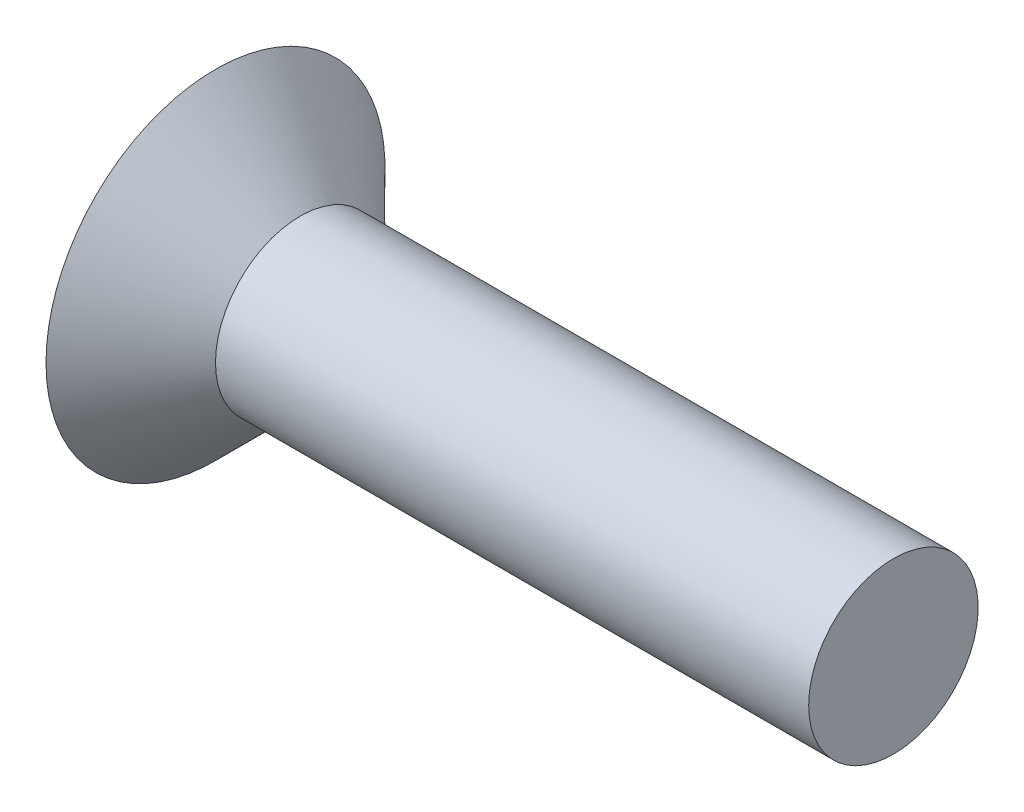
ISO-10303-21;
HEADER;
FILE_DESCRIPTION(('STEP AP214'),'2;1');
FILE_NAME('part.step','',(''),(''),'','','');
FILE_SCHEMA(('AUTOMOTIVE_DESIGN { 1 0 10303 214 1 1 1 1 }'));
ENDSEC;
DATA;
#1=APPLICATION_CONTEXT('core data for automotive mechanical design processes');
#2=APPLICATION_PROTOCOL_DEFINITION('international standard','automotive_design',2000,#1);
#3=PRODUCT_CONTEXT('',#1,'mechanical');
#4=PRODUCT('Part','Part','',(#3));
#5=PRODUCT_RELATED_PRODUCT_CATEGORY('part','',(#4));
#6=PRODUCT_DEFINITION_FORMATION('','',#4);
#7=PRODUCT_DEFINITION_CONTEXT('part definition',#1,'design');
#8=PRODUCT_DEFINITION('design','',#6,#7);
#9=PRODUCT_DEFINITION_SHAPE('','',#8);
#10=(LENGTH_UNIT() NAMED_UNIT(*) SI_UNIT(.MILLI.,.METRE.));
#11=(NAMED_UNIT(*) PLANE_ANGLE_UNIT() SI_UNIT($,.RADIAN.));
#12=(NAMED_UNIT(*) SI_UNIT($,.STERADIAN.) SOLID_ANGLE_UNIT());
#13=UNCERTAINTY_MEASURE_WITH_UNIT(LENGTH_MEASURE(1.E-05),#10,'distance_accuracy_value','');
#14=(GEOMETRIC_REPRESENTATION_CONTEXT(3) GLOBAL_UNCERTAINTY_ASSIGNED_CONTEXT((#13)) GLOBAL_UNIT_ASSIGNED_CONTEXT((#10,
#11,#12)) REPRESENTATION_CONTEXT('',''));
#15=CARTESIAN_POINT('',(0.,0.,0.));
#16=DIRECTION('',(0.,0.,1.));
#17=DIRECTION('',(1.,0.,0.));
#18=AXIS2_PLACEMENT_3D('',#15,#16,#17);
#19=CARTESIAN_POINT('',(0.,0.,0.));
#20=DIRECTION('',(-1.,0.,0.));
#21=DIRECTION('',(0.,0.,1.));
#22=AXIS2_PLACEMENT_3D('',#19,#20,#21);
#23=PLANE('',#22);
#24=DIRECTION('',(0.,0.5,-0.866025403784439));
#25=VECTOR('',#24,1.);
#26=CARTESIAN_POINT('',(0.,0.577350269189626,1.));
#27=LINE('',#26,#25);
#28=CARTESIAN_POINT('',(0.,0.577350269189626,1.));
#29=VERTEX_POINT('',#28);
#30=CARTESIAN_POINT('',(0.,1.15470053837925,0.));
#31=VERTEX_POINT('',#30);
#32=EDGE_CURVE('E53',#29,#31,#27,.T.);
#33=ORIENTED_EDGE('',*,*,#32,.F.);
#34=DIRECTION('',(0.,1.,0.));
#35=VECTOR('',#34,1.);
#36=CARTESIAN_POINT('',(0.,-0.577350269189626,1.));
#37=LINE('',#36,#35);
#38=CARTESIAN_POINT('',(0.,-0.577350269189626,1.));
#39=VERTEX_POINT('',#38);
#40=EDGE_CURVE('E136',#39,#29,#37,.T.);
#41=ORIENTED_EDGE('',*,*,#40,.F.);
#42=DIRECTION('',(0.,0.5,0.866025403784439));
#43=VECTOR('',#42,1.);
#44=CARTESIAN_POINT('',(0.,-1.15470053837925,0.));
#45=LINE('',#44,#43);
#46=CARTESIAN_POINT('',(0.,-1.15470053837925,0.));
#47=VERTEX_POINT('',#46);
#48=EDGE_CURVE('E134',#47,#39,#45,.T.);
#49=ORIENTED_EDGE('',*,*,#48,.F.);
#50=DIRECTION('',(0.,-0.5,0.866025403784439));
#51=VECTOR('',#50,1.);
#52=CARTESIAN_POINT('',(0.,-0.577350269189626,-1.));
#53=LINE('',#52,#51);
#54=CARTESIAN_POINT('',(0.,-0.577350269189626,-1.));
#55=VERTEX_POINT('',#54);
#56=EDGE_CURVE('E101',#55,#47,#53,.T.);
#57=ORIENTED_EDGE('',*,*,#56,.F.);
#58=DIRECTION('',(0.,-1.,0.));
#59=VECTOR('',#58,1.);
#60=CARTESIAN_POINT('',(0.,0.577350269189626,-1.));
#61=LINE('',#60,#59);
#62=CARTESIAN_POINT('',(0.,0.577350269189626,-1.));
#63=VERTEX_POINT('',#62);
#64=EDGE_CURVE('E130',#63,#55,#61,.T.);
#65=ORIENTED_EDGE('',*,*,#64,.F.);
#66=DIRECTION('',(0.,-0.5,-0.866025403784439));
#67=VECTOR('',#66,1.);
#68=CARTESIAN_POINT('',(0.,1.15470053837925,0.));
#69=LINE('',#68,#67);
#70=EDGE_CURVE('E127',#31,#63,#69,.T.);
#71=ORIENTED_EDGE('',*,*,#70,.F.);
#72=EDGE_LOOP('',(#33,#41,#49,#57,#65,#71));
#73=FACE_BOUND('',#72,.T.);
#74=CARTESIAN_POINT('',(0.,0.,0.));
#75=DIRECTION('',(-1.,0.,0.));
#76=DIRECTION('',(0.,0.,1.));
#77=AXIS2_PLACEMENT_3D('',#74,#75,#76);
#78=CIRCLE('',#77,3.);
#79=CARTESIAN_POINT('',(0.,0.,3.));
#80=VERTEX_POINT('',#79);
#81=EDGE_CURVE('E140',#80,#80,#78,.T.);
#82=ORIENTED_EDGE('',*,*,#81,.T.);
#83=EDGE_LOOP('',(#82));
#84=FACE_BOUND('',#83,.T.);
#85=ADVANCED_FACE('F39',(#73,#84),#23,.T.);
#86=CARTESIAN_POINT('',(12.,0.,0.));
#87=DIRECTION('',(-1.,0.,0.));
#88=DIRECTION('',(0.,0.,1.));
#89=AXIS2_PLACEMENT_3D('',#86,#87,#88);
#90=PLANE('',#89);
#91=CARTESIAN_POINT('',(12.,0.,0.));
#92=DIRECTION('',(-1.,0.,0.));
#93=DIRECTION('',(0.,0.,1.));
#94=AXIS2_PLACEMENT_3D('',#91,#92,#93);
#95=CIRCLE('',#94,1.5);
#96=CARTESIAN_POINT('',(12.,0.,1.5));
#97=VERTEX_POINT('',#96);
#98=EDGE_CURVE('E11',#97,#97,#95,.T.);
#99=ORIENTED_EDGE('',*,*,#98,.F.);
#100=EDGE_LOOP('',(#99));
#101=FACE_BOUND('',#100,.T.);
#102=ADVANCED_FACE('F155',(#101),#90,.F.);
#103=CARTESIAN_POINT('',(0.,0.,0.));
#104=DIRECTION('',(-1.,0.,0.));
#105=DIRECTION('',(0.,0.,1.));
#106=AXIS2_PLACEMENT_3D('',#103,#104,#105);
#107=CYLINDRICAL_SURFACE('',#106,1.5);
#108=CARTESIAN_POINT('',(1.50000000000001,0.,0.));
#109=DIRECTION('',(-1.,0.,0.));
#110=DIRECTION('',(0.,0.,1.));
#111=AXIS2_PLACEMENT_3D('',#108,#109,#110);
#112=CIRCLE('',#111,1.5);
#113=CARTESIAN_POINT('',(1.50000000000001,0.,1.5));
#114=VERTEX_POINT('',#113);
#115=EDGE_CURVE('E46',#114,#114,#112,.T.);
#116=ORIENTED_EDGE('',*,*,#115,.F.);
#117=EDGE_LOOP('',(#116));
#118=FACE_BOUND('',#117,.T.);
#119=ORIENTED_EDGE('',*,*,#98,.T.);
#120=EDGE_LOOP('',(#119));
#121=FACE_BOUND('',#120,.T.);
#122=ADVANCED_FACE('F152',(#118,#121),#107,.T.);
#123=CARTESIAN_POINT('',(1.50000000000001,0.,0.));
#124=DIRECTION('',(-1.,0.,0.));
#125=DIRECTION('',(0.,0.,1.));
#126=AXIS2_PLACEMENT_3D('',#123,#124,#125);
#127=CONICAL_SURFACE('',#126,1.5,0.785398163397446);
#128=ORIENTED_EDGE('',*,*,#81,.F.);
#129=EDGE_LOOP('',(#128));
#130=FACE_BOUND('',#129,.T.);
#131=ORIENTED_EDGE('',*,*,#115,.T.);
#132=EDGE_LOOP('',(#131));
#133=FACE_BOUND('',#132,.T.);
#134=ADVANCED_FACE('F150',(#130,#133),#127,.T.);
#135=CARTESIAN_POINT('',(1.,0.577350269189626,1.));
#136=DIRECTION('',(0.,0.866025403784439,0.5));
#137=DIRECTION('',(0.,-0.5,0.866025403784439));
#138=AXIS2_PLACEMENT_3D('',#135,#136,#137);
#139=PLANE('',#138);
#140=ORIENTED_EDGE('',*,*,#32,.T.);
#141=DIRECTION('',(-1.,0.,0.));
#142=VECTOR('',#141,1.);
#143=CARTESIAN_POINT('',(1.,1.15470053837925,0.));
#144=LINE('',#143,#142);
#145=CARTESIAN_POINT('',(1.,1.15470053837925,0.));
#146=VERTEX_POINT('',#145);
#147=EDGE_CURVE('E83',#146,#31,#144,.T.);
#148=ORIENTED_EDGE('',*,*,#147,.F.);
#149=DIRECTION('',(0.,0.5,-0.866025403784439));
#150=VECTOR('',#149,1.);
#151=CARTESIAN_POINT('',(1.,0.577350269189626,1.));
#152=LINE('',#151,#150);
#153=CARTESIAN_POINT('',(1.,0.577350269189626,1.));
#154=VERTEX_POINT('',#153);
#155=EDGE_CURVE('E138',#154,#146,#152,.T.);
#156=ORIENTED_EDGE('',*,*,#155,.F.);
#157=DIRECTION('',(-1.,0.,0.));
#158=VECTOR('',#157,1.);
#159=CARTESIAN_POINT('',(1.,0.577350269189626,1.));
#160=LINE('',#159,#158);
#161=EDGE_CURVE('E61',#154,#29,#160,.T.);
#162=ORIENTED_EDGE('',*,*,#161,.T.);
#163=EDGE_LOOP('',(#140,#148,#156,#162));
#164=FACE_BOUND('',#163,.T.);
#165=ADVANCED_FACE('F167',(#164),#139,.F.);
#166=CARTESIAN_POINT('',(1.,-0.577350269189626,1.));
#167=DIRECTION('',(0.,0.,1.));
#168=DIRECTION('',(1.,0.,0.));
#169=AXIS2_PLACEMENT_3D('',#166,#167,#168);
#170=PLANE('',#169);
#171=ORIENTED_EDGE('',*,*,#40,.T.);
#172=ORIENTED_EDGE('',*,*,#161,.F.);
#173=DIRECTION('',(0.,1.,0.));
#174=VECTOR('',#173,1.);
#175=CARTESIAN_POINT('',(1.,-0.577350269189626,1.));
#176=LINE('',#175,#174);
#177=CARTESIAN_POINT('',(1.,-0.577350269189626,1.));
#178=VERTEX_POINT('',#177);
#179=EDGE_CURVE('E113',#178,#154,#176,.T.);
#180=ORIENTED_EDGE('',*,*,#179,.F.);
#181=DIRECTION('',(-1.,0.,0.));
#182=VECTOR('',#181,1.);
#183=CARTESIAN_POINT('',(1.,-0.577350269189626,1.));
#184=LINE('',#183,#182);
#185=EDGE_CURVE('E105',#178,#39,#184,.T.);
#186=ORIENTED_EDGE('',*,*,#185,.T.);
#187=EDGE_LOOP('',(#171,#172,#180,#186));
#188=FACE_BOUND('',#187,.T.);
#189=ADVANCED_FACE('F171',(#188),#170,.F.);
#190=CARTESIAN_POINT('',(1.,-1.15470053837925,0.));
#191=DIRECTION('',(0.,-0.866025403784439,0.5));
#192=DIRECTION('',(0.,-0.5,-0.866025403784439));
#193=AXIS2_PLACEMENT_3D('',#190,#191,#192);
#194=PLANE('',#193);
#195=ORIENTED_EDGE('',*,*,#48,.T.);
#196=ORIENTED_EDGE('',*,*,#185,.F.);
#197=DIRECTION('',(0.,0.5,0.866025403784439));
#198=VECTOR('',#197,1.);
#199=CARTESIAN_POINT('',(1.,-1.15470053837925,0.));
#200=LINE('',#199,#198);
#201=CARTESIAN_POINT('',(1.,-1.15470053837925,0.));
#202=VERTEX_POINT('',#201);
#203=EDGE_CURVE('E109',#202,#178,#200,.T.);
#204=ORIENTED_EDGE('',*,*,#203,.F.);
#205=DIRECTION('',(-1.,0.,0.));
#206=VECTOR('',#205,1.);
#207=CARTESIAN_POINT('',(1.,-1.15470053837925,0.));
#208=LINE('',#207,#206);
#209=EDGE_CURVE('E94',#202,#47,#208,.T.);
#210=ORIENTED_EDGE('',*,*,#209,.T.);
#211=EDGE_LOOP('',(#195,#196,#204,#210));
#212=FACE_BOUND('',#211,.T.);
#213=ADVANCED_FACE('F110',(#212),#194,.F.);
#214=CARTESIAN_POINT('',(1.,-0.577350269189626,-1.));
#215=DIRECTION('',(0.,-0.866025403784439,-0.5));
#216=DIRECTION('',(0.,0.5,-0.866025403784439));
#217=AXIS2_PLACEMENT_3D('',#214,#215,#216);
#218=PLANE('',#217);
#219=ORIENTED_EDGE('',*,*,#56,.T.);
#220=ORIENTED_EDGE('',*,*,#209,.F.);
#221=DIRECTION('',(0.,-0.5,0.866025403784439));
#222=VECTOR('',#221,1.);
#223=CARTESIAN_POINT('',(1.,-0.577350269189626,-1.));
#224=LINE('',#223,#222);
#225=CARTESIAN_POINT('',(1.,-0.577350269189626,-1.));
#226=VERTEX_POINT('',#225);
#227=EDGE_CURVE('E98',#226,#202,#224,.T.);
#228=ORIENTED_EDGE('',*,*,#227,.F.);
#229=DIRECTION('',(-1.,0.,0.));
#230=VECTOR('',#229,1.);
#231=CARTESIAN_POINT('',(1.,-0.577350269189626,-1.));
#232=LINE('',#231,#230);
#233=EDGE_CURVE('E106',#226,#55,#232,.T.);
#234=ORIENTED_EDGE('',*,*,#233,.T.);
#235=EDGE_LOOP('',(#219,#220,#228,#234));
#236=FACE_BOUND('',#235,.T.);
#237=ADVANCED_FACE('F96',(#236),#218,.F.);
#238=CARTESIAN_POINT('',(1.,0.577350269189626,-1.));
#239=DIRECTION('',(0.,0.,-1.));
#240=DIRECTION('',(-1.,0.,0.));
#241=AXIS2_PLACEMENT_3D('',#238,#239,#240);
#242=PLANE('',#241);
#243=ORIENTED_EDGE('',*,*,#64,.T.);
#244=ORIENTED_EDGE('',*,*,#233,.F.);
#245=DIRECTION('',(0.,-1.,0.));
#246=VECTOR('',#245,1.);
#247=CARTESIAN_POINT('',(1.,0.577350269189626,-1.));
#248=LINE('',#247,#246);
#249=CARTESIAN_POINT('',(1.,0.577350269189626,-1.));
#250=VERTEX_POINT('',#249);
#251=EDGE_CURVE('E119',#250,#226,#248,.T.);
#252=ORIENTED_EDGE('',*,*,#251,.F.);
#253=DIRECTION('',(-1.,0.,0.));
#254=VECTOR('',#253,1.);
#255=CARTESIAN_POINT('',(1.,0.577350269189626,-1.));
#256=LINE('',#255,#254);
#257=EDGE_CURVE('E143',#250,#63,#256,.T.);
#258=ORIENTED_EDGE('',*,*,#257,.T.);
#259=EDGE_LOOP('',(#243,#244,#252,#258));
#260=FACE_BOUND('',#259,.T.);
#261=ADVANCED_FACE('F175',(#260),#242,.F.);
#262=CARTESIAN_POINT('',(1.,1.15470053837925,0.));
#263=DIRECTION('',(0.,0.866025403784439,-0.5));
#264=DIRECTION('',(0.,0.5,0.866025403784439));
#265=AXIS2_PLACEMENT_3D('',#262,#263,#264);
#266=PLANE('',#265);
#267=ORIENTED_EDGE('',*,*,#70,.T.);
#268=ORIENTED_EDGE('',*,*,#257,.F.);
#269=DIRECTION('',(0.,-0.5,-0.866025403784439));
#270=VECTOR('',#269,1.);
#271=CARTESIAN_POINT('',(1.,1.15470053837925,0.));
#272=LINE('',#271,#270);
#273=EDGE_CURVE('E121',#146,#250,#272,.T.);
#274=ORIENTED_EDGE('',*,*,#273,.F.);
#275=ORIENTED_EDGE('',*,*,#147,.T.);
#276=EDGE_LOOP('',(#267,#268,#274,#275));
#277=FACE_BOUND('',#276,.T.);
#278=ADVANCED_FACE('F172',(#277),#266,.F.);
#279=CARTESIAN_POINT('',(1.,0.,0.));
#280=DIRECTION('',(-1.,0.,0.));
#281=DIRECTION('',(0.,0.,1.));
#282=AXIS2_PLACEMENT_3D('',#279,#280,#281);
#283=PLANE('',#282);
#284=ORIENTED_EDGE('',*,*,#155,.T.);
#285=ORIENTED_EDGE('',*,*,#273,.T.);
#286=ORIENTED_EDGE('',*,*,#251,.T.);
#287=ORIENTED_EDGE('',*,*,#227,.T.);
#288=ORIENTED_EDGE('',*,*,#203,.T.);
#289=ORIENTED_EDGE('',*,*,#179,.T.);
#290=EDGE_LOOP('',(#284,#285,#286,#287,#288,#289));
#291=FACE_BOUND('',#290,.T.);
#292=ADVANCED_FACE('F116',(#291),#283,.T.);
#293=CLOSED_SHELL('',(#85,#102,#122,#134,#165,#189,#213,#237,#261,#278,#292));
#294=MANIFOLD_SOLID_BREP('B2',#293);
#295=ADVANCED_BREP_SHAPE_REPRESENTATION('',(#18,#294),#14);
#296=SHAPE_DEFINITION_REPRESENTATION(#9,#295);
ENDSEC;
END-ISO-10303-21;
